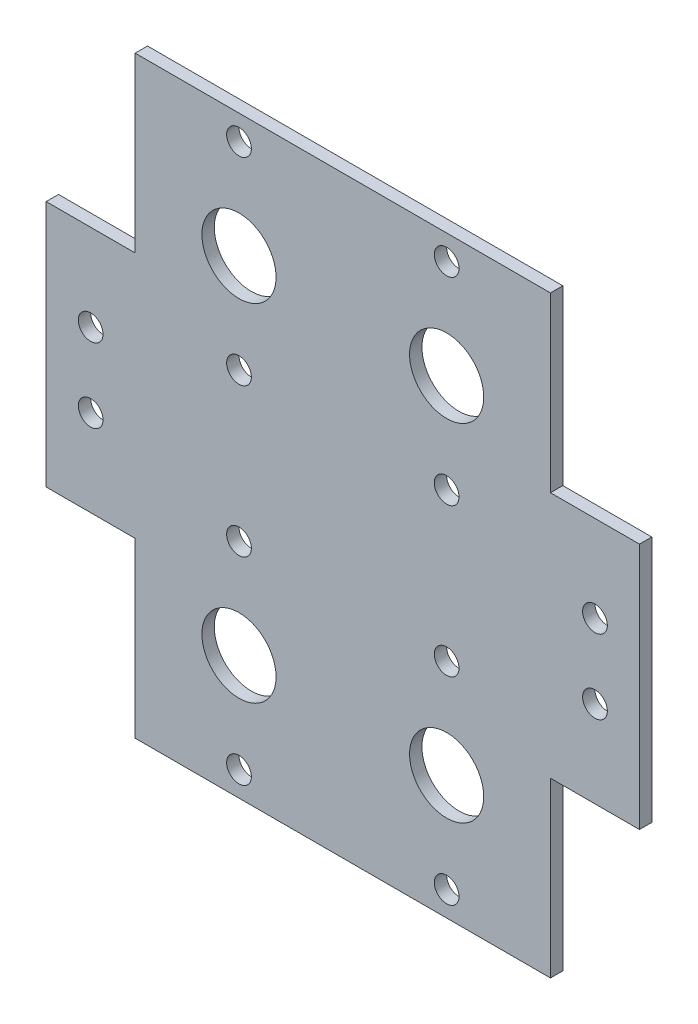
ISO-10303-21;
HEADER;
FILE_DESCRIPTION(('STEP AP214'),'2;1');
FILE_NAME('part.step','',(''),(''),'','','');
FILE_SCHEMA(('AUTOMOTIVE_DESIGN { 1 0 10303 214 1 1 1 1 }'));
ENDSEC;
DATA;
#1=APPLICATION_CONTEXT('core data for automotive mechanical design processes');
#2=APPLICATION_PROTOCOL_DEFINITION('international standard','automotive_design',2000,#1);
#3=PRODUCT_CONTEXT('',#1,'mechanical');
#4=PRODUCT('Part','Part','',(#3));
#5=PRODUCT_RELATED_PRODUCT_CATEGORY('part','',(#4));
#6=PRODUCT_DEFINITION_FORMATION('','',#4);
#7=PRODUCT_DEFINITION_CONTEXT('part definition',#1,'design');
#8=PRODUCT_DEFINITION('design','',#6,#7);
#9=PRODUCT_DEFINITION_SHAPE('','',#8);
#10=(LENGTH_UNIT() NAMED_UNIT(*) SI_UNIT(.MILLI.,.METRE.));
#11=(NAMED_UNIT(*) PLANE_ANGLE_UNIT() SI_UNIT($,.RADIAN.));
#12=(NAMED_UNIT(*) SI_UNIT($,.STERADIAN.) SOLID_ANGLE_UNIT());
#13=UNCERTAINTY_MEASURE_WITH_UNIT(LENGTH_MEASURE(1.E-05),#10,'distance_accuracy_value','');
#14=(GEOMETRIC_REPRESENTATION_CONTEXT(3) GLOBAL_UNCERTAINTY_ASSIGNED_CONTEXT((#13)) GLOBAL_UNIT_ASSIGNED_CONTEXT((#10,
#11,#12)) REPRESENTATION_CONTEXT('',''));
#15=CARTESIAN_POINT('',(0.,0.,0.));
#16=DIRECTION('',(0.,0.,1.));
#17=DIRECTION('',(1.,0.,0.));
#18=AXIS2_PLACEMENT_3D('',#15,#16,#17);
#19=CARTESIAN_POINT('',(-120.,50.,5.));
#20=DIRECTION('',(0.,-1.,0.));
#21=DIRECTION('',(0.,0.,-1.));
#22=AXIS2_PLACEMENT_3D('',#19,#20,#21);
#23=PLANE('',#22);
#24=DIRECTION('',(-1.,0.,0.));
#25=VECTOR('',#24,1.);
#26=CARTESIAN_POINT('',(-120.,50.,0.));
#27=LINE('',#26,#25);
#28=CARTESIAN_POINT('',(120.,50.,0.));
#29=VERTEX_POINT('',#28);
#30=CARTESIAN_POINT('',(84.,50.,0.));
#31=VERTEX_POINT('',#30);
#32=EDGE_CURVE('E210',#29,#31,#27,.T.);
#33=ORIENTED_EDGE('',*,*,#32,.T.);
#34=DIRECTION('',(0.,0.,1.));
#35=VECTOR('',#34,1.);
#36=CARTESIAN_POINT('',(84.,50.,5.));
#37=LINE('',#36,#35);
#38=CARTESIAN_POINT('',(84.,50.,5.));
#39=VERTEX_POINT('',#38);
#40=EDGE_CURVE('E143',#31,#39,#37,.T.);
#41=ORIENTED_EDGE('',*,*,#40,.T.);
#42=DIRECTION('',(-1.,0.,0.));
#43=VECTOR('',#42,1.);
#44=CARTESIAN_POINT('',(-120.,50.,5.));
#45=LINE('',#44,#43);
#46=CARTESIAN_POINT('',(120.,50.,5.));
#47=VERTEX_POINT('',#46);
#48=EDGE_CURVE('E197',#47,#39,#45,.T.);
#49=ORIENTED_EDGE('',*,*,#48,.F.);
#50=DIRECTION('',(0.,0.,-1.));
#51=VECTOR('',#50,1.);
#52=CARTESIAN_POINT('',(120.,50.,5.));
#53=LINE('',#52,#51);
#54=EDGE_CURVE('E13',#47,#29,#53,.T.);
#55=ORIENTED_EDGE('',*,*,#54,.T.);
#56=EDGE_LOOP('',(#33,#41,#49,#55));
#57=FACE_BOUND('',#56,.T.);
#58=ADVANCED_FACE('F47',(#57),#23,.F.);
#59=CARTESIAN_POINT('',(-120.,-50.,5.));
#60=DIRECTION('',(0.,1.,0.));
#61=DIRECTION('',(0.,0.,1.));
#62=AXIS2_PLACEMENT_3D('',#59,#60,#61);
#63=PLANE('',#62);
#64=DIRECTION('',(1.,0.,0.));
#65=VECTOR('',#64,1.);
#66=CARTESIAN_POINT('',(-120.,-50.,5.));
#67=LINE('',#66,#65);
#68=CARTESIAN_POINT('',(84.,-50.,5.));
#69=VERTEX_POINT('',#68);
#70=CARTESIAN_POINT('',(120.,-50.,5.));
#71=VERTEX_POINT('',#70);
#72=EDGE_CURVE('E202',#69,#71,#67,.T.);
#73=ORIENTED_EDGE('',*,*,#72,.F.);
#74=DIRECTION('',(0.,0.,-1.));
#75=VECTOR('',#74,1.);
#76=CARTESIAN_POINT('',(84.,-50.,5.));
#77=LINE('',#76,#75);
#78=CARTESIAN_POINT('',(84.,-50.,0.));
#79=VERTEX_POINT('',#78);
#80=EDGE_CURVE('E187',#69,#79,#77,.T.);
#81=ORIENTED_EDGE('',*,*,#80,.T.);
#82=DIRECTION('',(1.,0.,0.));
#83=VECTOR('',#82,1.);
#84=CARTESIAN_POINT('',(-120.,-50.,0.));
#85=LINE('',#84,#83);
#86=CARTESIAN_POINT('',(120.,-50.,0.));
#87=VERTEX_POINT('',#86);
#88=EDGE_CURVE('E214',#79,#87,#85,.T.);
#89=ORIENTED_EDGE('',*,*,#88,.T.);
#90=DIRECTION('',(0.,0.,-1.));
#91=VECTOR('',#90,1.);
#92=CARTESIAN_POINT('',(120.,-50.,5.));
#93=LINE('',#92,#91);
#94=EDGE_CURVE('E206',#71,#87,#93,.T.);
#95=ORIENTED_EDGE('',*,*,#94,.F.);
#96=EDGE_LOOP('',(#73,#81,#89,#95));
#97=FACE_BOUND('',#96,.T.);
#98=ADVANCED_FACE('F394',(#97),#63,.F.);
#99=CARTESIAN_POINT('',(120.,-50.,5.));
#100=DIRECTION('',(-1.,0.,0.));
#101=DIRECTION('',(0.,0.,1.));
#102=AXIS2_PLACEMENT_3D('',#99,#100,#101);
#103=PLANE('',#102);
#104=DIRECTION('',(0.,1.,0.));
#105=VECTOR('',#104,1.);
#106=CARTESIAN_POINT('',(120.,-50.,0.));
#107=LINE('',#106,#105);
#108=EDGE_CURVE('E191',#87,#29,#107,.T.);
#109=ORIENTED_EDGE('',*,*,#108,.T.);
#110=ORIENTED_EDGE('',*,*,#54,.F.);
#111=DIRECTION('',(0.,1.,0.));
#112=VECTOR('',#111,1.);
#113=CARTESIAN_POINT('',(120.,-50.,5.));
#114=LINE('',#113,#112);
#115=EDGE_CURVE('E192',#71,#47,#114,.T.);
#116=ORIENTED_EDGE('',*,*,#115,.F.);
#117=ORIENTED_EDGE('',*,*,#94,.T.);
#118=EDGE_LOOP('',(#109,#110,#116,#117));
#119=FACE_BOUND('',#118,.T.);
#120=ADVANCED_FACE('F49',(#119),#103,.F.);
#121=CARTESIAN_POINT('',(-84.,50.,5.));
#122=VERTEX_POINT('',#121);
#123=CARTESIAN_POINT('',(-120.,50.,5.));
#124=VERTEX_POINT('',#123);
#125=EDGE_CURVE('E195',#122,#124,#45,.T.);
#126=ORIENTED_EDGE('',*,*,#125,.F.);
#127=DIRECTION('',(0.,0.,-1.));
#128=VECTOR('',#127,1.);
#129=CARTESIAN_POINT('',(-84.,50.,5.));
#130=LINE('',#129,#128);
#131=CARTESIAN_POINT('',(-84.,50.,0.));
#132=VERTEX_POINT('',#131);
#133=EDGE_CURVE('E184',#122,#132,#130,.T.);
#134=ORIENTED_EDGE('',*,*,#133,.T.);
#135=CARTESIAN_POINT('',(-120.,50.,0.));
#136=VERTEX_POINT('',#135);
#137=EDGE_CURVE('E209',#132,#136,#27,.T.);
#138=ORIENTED_EDGE('',*,*,#137,.T.);
#139=DIRECTION('',(0.,0.,-1.));
#140=VECTOR('',#139,1.);
#141=CARTESIAN_POINT('',(-120.,50.,5.));
#142=LINE('',#141,#140);
#143=EDGE_CURVE('E55',#124,#136,#142,.T.);
#144=ORIENTED_EDGE('',*,*,#143,.F.);
#145=EDGE_LOOP('',(#126,#134,#138,#144));
#146=FACE_BOUND('',#145,.T.);
#147=ADVANCED_FACE('F237',(#146),#23,.F.);
#148=CARTESIAN_POINT('',(-120.,-50.,5.));
#149=DIRECTION('',(1.,0.,0.));
#150=DIRECTION('',(0.,0.,-1.));
#151=AXIS2_PLACEMENT_3D('',#148,#149,#150);
#152=PLANE('',#151);
#153=DIRECTION('',(0.,-1.,0.));
#154=VECTOR('',#153,1.);
#155=CARTESIAN_POINT('',(-120.,-50.,0.));
#156=LINE('',#155,#154);
#157=CARTESIAN_POINT('',(-120.,-50.,0.));
#158=VERTEX_POINT('',#157);
#159=EDGE_CURVE('E212',#136,#158,#156,.T.);
#160=ORIENTED_EDGE('',*,*,#159,.T.);
#161=DIRECTION('',(0.,0.,-1.));
#162=VECTOR('',#161,1.);
#163=CARTESIAN_POINT('',(-120.,-50.,5.));
#164=LINE('',#163,#162);
#165=CARTESIAN_POINT('',(-120.,-50.,5.));
#166=VERTEX_POINT('',#165);
#167=EDGE_CURVE('E219',#166,#158,#164,.T.);
#168=ORIENTED_EDGE('',*,*,#167,.F.);
#169=DIRECTION('',(0.,-1.,0.));
#170=VECTOR('',#169,1.);
#171=CARTESIAN_POINT('',(-120.,-50.,5.));
#172=LINE('',#171,#170);
#173=EDGE_CURVE('E200',#124,#166,#172,.T.);
#174=ORIENTED_EDGE('',*,*,#173,.F.);
#175=ORIENTED_EDGE('',*,*,#143,.T.);
#176=EDGE_LOOP('',(#160,#168,#174,#175));
#177=FACE_BOUND('',#176,.T.);
#178=ADVANCED_FACE('F226',(#177),#152,.F.);
#179=CARTESIAN_POINT('',(-84.,-50.,0.));
#180=VERTEX_POINT('',#179);
#181=EDGE_CURVE('E196',#158,#180,#85,.T.);
#182=ORIENTED_EDGE('',*,*,#181,.T.);
#183=DIRECTION('',(0.,0.,1.));
#184=VECTOR('',#183,1.);
#185=CARTESIAN_POINT('',(-84.,-50.,5.));
#186=LINE('',#185,#184);
#187=CARTESIAN_POINT('',(-84.,-50.,5.));
#188=VERTEX_POINT('',#187);
#189=EDGE_CURVE('E177',#180,#188,#186,.T.);
#190=ORIENTED_EDGE('',*,*,#189,.T.);
#191=EDGE_CURVE('E203',#166,#188,#67,.T.);
#192=ORIENTED_EDGE('',*,*,#191,.F.);
#193=ORIENTED_EDGE('',*,*,#167,.T.);
#194=EDGE_LOOP('',(#182,#190,#192,#193));
#195=FACE_BOUND('',#194,.T.);
#196=ADVANCED_FACE('F234',(#195),#63,.F.);
#197=CARTESIAN_POINT('',(0.,0.,5.));
#198=DIRECTION('',(0.,0.,-1.));
#199=DIRECTION('',(-1.,0.,0.));
#200=AXIS2_PLACEMENT_3D('',#197,#198,#199);
#201=PLANE('',#200);
#202=CARTESIAN_POINT('',(42.,-30.,5.));
#203=DIRECTION('',(0.,0.,1.));
#204=DIRECTION('',(-1.,0.,0.));
#205=AXIS2_PLACEMENT_3D('',#202,#203,#204);
#206=CIRCLE('',#205,5.);
#207=CARTESIAN_POINT('',(37.,-30.,5.));
#208=VERTEX_POINT('',#207);
#209=EDGE_CURVE('E292',#208,#208,#206,.T.);
#210=ORIENTED_EDGE('',*,*,#209,.F.);
#211=EDGE_LOOP('',(#210));
#212=FACE_BOUND('',#211,.T.);
#213=CARTESIAN_POINT('',(42.,-110.,5.));
#214=DIRECTION('',(0.,0.,1.));
#215=DIRECTION('',(-1.,0.,0.));
#216=AXIS2_PLACEMENT_3D('',#213,#214,#215);
#217=CIRCLE('',#216,5.);
#218=CARTESIAN_POINT('',(37.,-110.,5.));
#219=VERTEX_POINT('',#218);
#220=EDGE_CURVE('E327',#219,#219,#217,.T.);
#221=ORIENTED_EDGE('',*,*,#220,.F.);
#222=EDGE_LOOP('',(#221));
#223=FACE_BOUND('',#222,.T.);
#224=CARTESIAN_POINT('',(-42.,-110.,5.));
#225=DIRECTION('',(0.,0.,1.));
#226=DIRECTION('',(1.,0.,0.));
#227=AXIS2_PLACEMENT_3D('',#224,#225,#226);
#228=CIRCLE('',#227,5.);
#229=CARTESIAN_POINT('',(-37.,-110.,5.));
#230=VERTEX_POINT('',#229);
#231=EDGE_CURVE('E333',#230,#230,#228,.T.);
#232=ORIENTED_EDGE('',*,*,#231,.F.);
#233=EDGE_LOOP('',(#232));
#234=FACE_BOUND('',#233,.T.);
#235=CARTESIAN_POINT('',(-42.,-30.,5.));
#236=DIRECTION('',(0.,0.,1.));
#237=DIRECTION('',(1.,0.,0.));
#238=AXIS2_PLACEMENT_3D('',#235,#236,#237);
#239=CIRCLE('',#238,5.);
#240=CARTESIAN_POINT('',(-37.,-30.,5.));
#241=VERTEX_POINT('',#240);
#242=EDGE_CURVE('E310',#241,#241,#239,.T.);
#243=ORIENTED_EDGE('',*,*,#242,.F.);
#244=EDGE_LOOP('',(#243));
#245=FACE_BOUND('',#244,.T.);
#246=CARTESIAN_POINT('',(42.,-70.,5.));
#247=DIRECTION('',(0.,0.,1.));
#248=DIRECTION('',(-1.,0.,0.));
#249=AXIS2_PLACEMENT_3D('',#246,#247,#248);
#250=CIRCLE('',#249,15.);
#251=CARTESIAN_POINT('',(27.,-70.,5.));
#252=VERTEX_POINT('',#251);
#253=EDGE_CURVE('E317',#252,#252,#250,.T.);
#254=ORIENTED_EDGE('',*,*,#253,.F.);
#255=EDGE_LOOP('',(#254));
#256=FACE_BOUND('',#255,.T.);
#257=CARTESIAN_POINT('',(-42.,70.,5.));
#258=DIRECTION('',(0.,0.,1.));
#259=DIRECTION('',(-1.,0.,0.));
#260=AXIS2_PLACEMENT_3D('',#257,#258,#259);
#261=CIRCLE('',#260,15.);
#262=CARTESIAN_POINT('',(-57.,70.,5.));
#263=VERTEX_POINT('',#262);
#264=EDGE_CURVE('E293',#263,#263,#261,.T.);
#265=ORIENTED_EDGE('',*,*,#264,.F.);
#266=EDGE_LOOP('',(#265));
#267=FACE_BOUND('',#266,.T.);
#268=CARTESIAN_POINT('',(42.,70.,5.));
#269=DIRECTION('',(0.,0.,1.));
#270=DIRECTION('',(1.,0.,0.));
#271=AXIS2_PLACEMENT_3D('',#268,#269,#270);
#272=CIRCLE('',#271,15.);
#273=CARTESIAN_POINT('',(57.,70.,5.));
#274=VERTEX_POINT('',#273);
#275=EDGE_CURVE('E299',#274,#274,#272,.T.);
#276=ORIENTED_EDGE('',*,*,#275,.F.);
#277=EDGE_LOOP('',(#276));
#278=FACE_BOUND('',#277,.T.);
#279=CARTESIAN_POINT('',(-42.,30.,5.));
#280=DIRECTION('',(0.,0.,1.));
#281=DIRECTION('',(-1.,0.,0.));
#282=AXIS2_PLACEMENT_3D('',#279,#280,#281);
#283=CIRCLE('',#282,5.);
#284=CARTESIAN_POINT('',(-47.,30.,5.));
#285=VERTEX_POINT('',#284);
#286=EDGE_CURVE('E305',#285,#285,#283,.T.);
#287=ORIENTED_EDGE('',*,*,#286,.F.);
#288=EDGE_LOOP('',(#287));
#289=FACE_BOUND('',#288,.T.);
#290=CARTESIAN_POINT('',(-42.,110.,5.));
#291=DIRECTION('',(0.,0.,1.));
#292=DIRECTION('',(-1.,0.,0.));
#293=AXIS2_PLACEMENT_3D('',#290,#291,#292);
#294=CIRCLE('',#293,5.);
#295=CARTESIAN_POINT('',(-47.,110.,5.));
#296=VERTEX_POINT('',#295);
#297=EDGE_CURVE('E273',#296,#296,#294,.T.);
#298=ORIENTED_EDGE('',*,*,#297,.F.);
#299=EDGE_LOOP('',(#298));
#300=FACE_BOUND('',#299,.T.);
#301=CARTESIAN_POINT('',(42.,110.,5.));
#302=DIRECTION('',(0.,0.,1.));
#303=DIRECTION('',(1.,0.,0.));
#304=AXIS2_PLACEMENT_3D('',#301,#302,#303);
#305=CIRCLE('',#304,5.);
#306=CARTESIAN_POINT('',(47.,110.,5.));
#307=VERTEX_POINT('',#306);
#308=EDGE_CURVE('E280',#307,#307,#305,.T.);
#309=ORIENTED_EDGE('',*,*,#308,.F.);
#310=EDGE_LOOP('',(#309));
#311=FACE_BOUND('',#310,.T.);
#312=CARTESIAN_POINT('',(42.,30.,5.));
#313=DIRECTION('',(0.,0.,1.));
#314=DIRECTION('',(1.,0.,0.));
#315=AXIS2_PLACEMENT_3D('',#312,#313,#314);
#316=CIRCLE('',#315,5.);
#317=CARTESIAN_POINT('',(47.,30.,5.));
#318=VERTEX_POINT('',#317);
#319=EDGE_CURVE('E286',#318,#318,#316,.T.);
#320=ORIENTED_EDGE('',*,*,#319,.F.);
#321=EDGE_LOOP('',(#320));
#322=FACE_BOUND('',#321,.T.);
#323=CARTESIAN_POINT('',(-42.,-70.,5.));
#324=DIRECTION('',(0.,0.,1.));
#325=DIRECTION('',(1.,0.,0.));
#326=AXIS2_PLACEMENT_3D('',#323,#324,#325);
#327=CIRCLE('',#326,15.);
#328=CARTESIAN_POINT('',(-27.,-70.,5.));
#329=VERTEX_POINT('',#328);
#330=EDGE_CURVE('E267',#329,#329,#327,.T.);
#331=ORIENTED_EDGE('',*,*,#330,.F.);
#332=EDGE_LOOP('',(#331));
#333=FACE_BOUND('',#332,.T.);
#334=CARTESIAN_POINT('',(102.,15.,5.));
#335=DIRECTION('',(0.,0.,1.));
#336=DIRECTION('',(-1.,0.,0.));
#337=AXIS2_PLACEMENT_3D('',#334,#335,#336);
#338=CIRCLE('',#337,5.);
#339=CARTESIAN_POINT('',(97.,15.,5.));
#340=VERTEX_POINT('',#339);
#341=EDGE_CURVE('E262',#340,#340,#338,.T.);
#342=ORIENTED_EDGE('',*,*,#341,.F.);
#343=EDGE_LOOP('',(#342));
#344=FACE_BOUND('',#343,.T.);
#345=CARTESIAN_POINT('',(102.,-15.,5.));
#346=DIRECTION('',(0.,0.,1.));
#347=DIRECTION('',(1.,0.,0.));
#348=AXIS2_PLACEMENT_3D('',#345,#346,#347);
#349=CIRCLE('',#348,5.);
#350=CARTESIAN_POINT('',(107.,-15.,5.));
#351=VERTEX_POINT('',#350);
#352=EDGE_CURVE('E256',#351,#351,#349,.T.);
#353=ORIENTED_EDGE('',*,*,#352,.F.);
#354=EDGE_LOOP('',(#353));
#355=FACE_BOUND('',#354,.T.);
#356=CARTESIAN_POINT('',(-102.,-15.,5.));
#357=DIRECTION('',(0.,0.,1.));
#358=DIRECTION('',(-1.,0.,0.));
#359=AXIS2_PLACEMENT_3D('',#356,#357,#358);
#360=CIRCLE('',#359,5.00000000000001);
#361=CARTESIAN_POINT('',(-107.,-15.,5.));
#362=VERTEX_POINT('',#361);
#363=EDGE_CURVE('E249',#362,#362,#360,.T.);
#364=ORIENTED_EDGE('',*,*,#363,.F.);
#365=EDGE_LOOP('',(#364));
#366=FACE_BOUND('',#365,.T.);
#367=CARTESIAN_POINT('',(-102.,15.,5.));
#368=DIRECTION('',(0.,0.,1.));
#369=DIRECTION('',(1.,0.,0.));
#370=AXIS2_PLACEMENT_3D('',#367,#368,#369);
#371=CIRCLE('',#370,5.);
#372=CARTESIAN_POINT('',(-97.,15.,5.));
#373=VERTEX_POINT('',#372);
#374=EDGE_CURVE('E242',#373,#373,#371,.T.);
#375=ORIENTED_EDGE('',*,*,#374,.F.);
#376=EDGE_LOOP('',(#375));
#377=FACE_BOUND('',#376,.T.);
#378=ORIENTED_EDGE('',*,*,#191,.T.);
#379=DIRECTION('',(0.,-1.,0.));
#380=VECTOR('',#379,1.);
#381=CARTESIAN_POINT('',(-84.,-120.,5.));
#382=LINE('',#381,#380);
#383=CARTESIAN_POINT('',(-84.,-120.,5.));
#384=VERTEX_POINT('',#383);
#385=EDGE_CURVE('E172',#188,#384,#382,.T.);
#386=ORIENTED_EDGE('',*,*,#385,.T.);
#387=DIRECTION('',(1.,0.,0.));
#388=VECTOR('',#387,1.);
#389=CARTESIAN_POINT('',(-84.,-120.,5.));
#390=LINE('',#389,#388);
#391=CARTESIAN_POINT('',(84.,-120.,5.));
#392=VERTEX_POINT('',#391);
#393=EDGE_CURVE('E148',#384,#392,#390,.T.);
#394=ORIENTED_EDGE('',*,*,#393,.T.);
#395=DIRECTION('',(0.,1.,0.));
#396=VECTOR('',#395,1.);
#397=CARTESIAN_POINT('',(84.,-120.,5.));
#398=LINE('',#397,#396);
#399=EDGE_CURVE('E62',#392,#69,#398,.T.);
#400=ORIENTED_EDGE('',*,*,#399,.T.);
#401=ORIENTED_EDGE('',*,*,#72,.T.);
#402=ORIENTED_EDGE('',*,*,#115,.T.);
#403=ORIENTED_EDGE('',*,*,#48,.T.);
#404=CARTESIAN_POINT('',(84.,120.,5.));
#405=VERTEX_POINT('',#404);
#406=EDGE_CURVE('E170',#39,#405,#398,.T.);
#407=ORIENTED_EDGE('',*,*,#406,.T.);
#408=DIRECTION('',(-1.,0.,0.));
#409=VECTOR('',#408,1.);
#410=CARTESIAN_POINT('',(-84.,120.,5.));
#411=LINE('',#410,#409);
#412=CARTESIAN_POINT('',(-84.,120.,5.));
#413=VERTEX_POINT('',#412);
#414=EDGE_CURVE('E154',#405,#413,#411,.T.);
#415=ORIENTED_EDGE('',*,*,#414,.T.);
#416=EDGE_CURVE('E69',#413,#122,#382,.T.);
#417=ORIENTED_EDGE('',*,*,#416,.T.);
#418=ORIENTED_EDGE('',*,*,#125,.T.);
#419=ORIENTED_EDGE('',*,*,#173,.T.);
#420=EDGE_LOOP('',(#378,#386,#394,#400,#401,#402,#403,#407,#415,#417,#418,#419));
#421=FACE_BOUND('',#420,.T.);
#422=ADVANCED_FACE('F236',(#212,#223,#234,#245,#256,#267,#278,#289,#300,#311,#322,#333,#344,
#355,#366,#377,#421),#201,.F.);
#423=CARTESIAN_POINT('',(0.,0.,0.));
#424=DIRECTION('',(0.,0.,-1.));
#425=DIRECTION('',(-1.,0.,0.));
#426=AXIS2_PLACEMENT_3D('',#423,#424,#425);
#427=PLANE('',#426);
#428=CARTESIAN_POINT('',(42.,-30.,0.));
#429=DIRECTION('',(0.,0.,1.));
#430=DIRECTION('',(-1.,0.,0.));
#431=AXIS2_PLACEMENT_3D('',#428,#429,#430);
#432=CIRCLE('',#431,5.);
#433=CARTESIAN_POINT('',(37.,-30.,0.));
#434=VERTEX_POINT('',#433);
#435=EDGE_CURVE('E324',#434,#434,#432,.T.);
#436=ORIENTED_EDGE('',*,*,#435,.T.);
#437=EDGE_LOOP('',(#436));
#438=FACE_BOUND('',#437,.T.);
#439=CARTESIAN_POINT('',(42.,-110.,0.));
#440=DIRECTION('',(0.,0.,1.));
#441=DIRECTION('',(-1.,0.,0.));
#442=AXIS2_PLACEMENT_3D('',#439,#440,#441);
#443=CIRCLE('',#442,5.);
#444=CARTESIAN_POINT('',(37.,-110.,0.));
#445=VERTEX_POINT('',#444);
#446=EDGE_CURVE('E330',#445,#445,#443,.T.);
#447=ORIENTED_EDGE('',*,*,#446,.T.);
#448=EDGE_LOOP('',(#447));
#449=FACE_BOUND('',#448,.T.);
#450=CARTESIAN_POINT('',(-42.,-110.,0.));
#451=DIRECTION('',(0.,0.,1.));
#452=DIRECTION('',(1.,0.,0.));
#453=AXIS2_PLACEMENT_3D('',#450,#451,#452);
#454=CIRCLE('',#453,5.);
#455=CARTESIAN_POINT('',(-37.,-110.,0.));
#456=VERTEX_POINT('',#455);
#457=EDGE_CURVE('E314',#456,#456,#454,.T.);
#458=ORIENTED_EDGE('',*,*,#457,.T.);
#459=EDGE_LOOP('',(#458));
#460=FACE_BOUND('',#459,.T.);
#461=CARTESIAN_POINT('',(-42.,-30.,0.));
#462=DIRECTION('',(0.,0.,1.));
#463=DIRECTION('',(1.,0.,0.));
#464=AXIS2_PLACEMENT_3D('',#461,#462,#463);
#465=CIRCLE('',#464,5.);
#466=CARTESIAN_POINT('',(-37.,-30.,0.));
#467=VERTEX_POINT('',#466);
#468=EDGE_CURVE('E313',#467,#467,#465,.T.);
#469=ORIENTED_EDGE('',*,*,#468,.T.);
#470=EDGE_LOOP('',(#469));
#471=FACE_BOUND('',#470,.T.);
#472=CARTESIAN_POINT('',(42.,-70.,0.));
#473=DIRECTION('',(0.,0.,1.));
#474=DIRECTION('',(-1.,0.,0.));
#475=AXIS2_PLACEMENT_3D('',#472,#473,#474);
#476=CIRCLE('',#475,15.);
#477=CARTESIAN_POINT('',(27.,-70.,0.));
#478=VERTEX_POINT('',#477);
#479=EDGE_CURVE('E270',#478,#478,#476,.T.);
#480=ORIENTED_EDGE('',*,*,#479,.T.);
#481=EDGE_LOOP('',(#480));
#482=FACE_BOUND('',#481,.T.);
#483=CARTESIAN_POINT('',(-42.,70.,0.));
#484=DIRECTION('',(0.,0.,1.));
#485=DIRECTION('',(-1.,0.,0.));
#486=AXIS2_PLACEMENT_3D('',#483,#484,#485);
#487=CIRCLE('',#486,15.);
#488=CARTESIAN_POINT('',(-57.,70.,0.));
#489=VERTEX_POINT('',#488);
#490=EDGE_CURVE('E296',#489,#489,#487,.T.);
#491=ORIENTED_EDGE('',*,*,#490,.T.);
#492=EDGE_LOOP('',(#491));
#493=FACE_BOUND('',#492,.T.);
#494=CARTESIAN_POINT('',(42.,70.,0.));
#495=DIRECTION('',(0.,0.,1.));
#496=DIRECTION('',(1.,0.,0.));
#497=AXIS2_PLACEMENT_3D('',#494,#495,#496);
#498=CIRCLE('',#497,15.);
#499=CARTESIAN_POINT('',(57.,70.,0.));
#500=VERTEX_POINT('',#499);
#501=EDGE_CURVE('E302',#500,#500,#498,.T.);
#502=ORIENTED_EDGE('',*,*,#501,.T.);
#503=EDGE_LOOP('',(#502));
#504=FACE_BOUND('',#503,.T.);
#505=CARTESIAN_POINT('',(-42.,30.,0.));
#506=DIRECTION('',(0.,0.,1.));
#507=DIRECTION('',(-1.,0.,0.));
#508=AXIS2_PLACEMENT_3D('',#505,#506,#507);
#509=CIRCLE('',#508,5.);
#510=CARTESIAN_POINT('',(-47.,30.,0.));
#511=VERTEX_POINT('',#510);
#512=EDGE_CURVE('E277',#511,#511,#509,.T.);
#513=ORIENTED_EDGE('',*,*,#512,.T.);
#514=EDGE_LOOP('',(#513));
#515=FACE_BOUND('',#514,.T.);
#516=CARTESIAN_POINT('',(-42.,110.,0.));
#517=DIRECTION('',(0.,0.,1.));
#518=DIRECTION('',(-1.,0.,0.));
#519=AXIS2_PLACEMENT_3D('',#516,#517,#518);
#520=CIRCLE('',#519,5.);
#521=CARTESIAN_POINT('',(-47.,110.,0.));
#522=VERTEX_POINT('',#521);
#523=EDGE_CURVE('E276',#522,#522,#520,.T.);
#524=ORIENTED_EDGE('',*,*,#523,.T.);
#525=EDGE_LOOP('',(#524));
#526=FACE_BOUND('',#525,.T.);
#527=CARTESIAN_POINT('',(42.,110.,0.));
#528=DIRECTION('',(0.,0.,1.));
#529=DIRECTION('',(1.,0.,0.));
#530=AXIS2_PLACEMENT_3D('',#527,#528,#529);
#531=CIRCLE('',#530,5.);
#532=CARTESIAN_POINT('',(47.,110.,0.));
#533=VERTEX_POINT('',#532);
#534=EDGE_CURVE('E283',#533,#533,#531,.T.);
#535=ORIENTED_EDGE('',*,*,#534,.T.);
#536=EDGE_LOOP('',(#535));
#537=FACE_BOUND('',#536,.T.);
#538=CARTESIAN_POINT('',(42.,30.,0.));
#539=DIRECTION('',(0.,0.,1.));
#540=DIRECTION('',(1.,0.,0.));
#541=AXIS2_PLACEMENT_3D('',#538,#539,#540);
#542=CIRCLE('',#541,5.);
#543=CARTESIAN_POINT('',(47.,30.,0.));
#544=VERTEX_POINT('',#543);
#545=EDGE_CURVE('E289',#544,#544,#542,.T.);
#546=ORIENTED_EDGE('',*,*,#545,.T.);
#547=EDGE_LOOP('',(#546));
#548=FACE_BOUND('',#547,.T.);
#549=CARTESIAN_POINT('',(-42.,-70.,0.));
#550=DIRECTION('',(0.,0.,1.));
#551=DIRECTION('',(1.,0.,0.));
#552=AXIS2_PLACEMENT_3D('',#549,#550,#551);
#553=CIRCLE('',#552,15.);
#554=CARTESIAN_POINT('',(-27.,-70.,0.));
#555=VERTEX_POINT('',#554);
#556=EDGE_CURVE('E253',#555,#555,#553,.T.);
#557=ORIENTED_EDGE('',*,*,#556,.T.);
#558=EDGE_LOOP('',(#557));
#559=FACE_BOUND('',#558,.T.);
#560=CARTESIAN_POINT('',(102.,15.,0.));
#561=DIRECTION('',(0.,0.,1.));
#562=DIRECTION('',(-1.,0.,0.));
#563=AXIS2_PLACEMENT_3D('',#560,#561,#562);
#564=CIRCLE('',#563,5.);
#565=CARTESIAN_POINT('',(97.,15.,0.));
#566=VERTEX_POINT('',#565);
#567=EDGE_CURVE('E247',#566,#566,#564,.T.);
#568=ORIENTED_EDGE('',*,*,#567,.T.);
#569=EDGE_LOOP('',(#568));
#570=FACE_BOUND('',#569,.T.);
#571=CARTESIAN_POINT('',(102.,-15.,0.));
#572=DIRECTION('',(0.,0.,1.));
#573=DIRECTION('',(1.,0.,0.));
#574=AXIS2_PLACEMENT_3D('',#571,#572,#573);
#575=CIRCLE('',#574,5.);
#576=CARTESIAN_POINT('',(107.,-15.,0.));
#577=VERTEX_POINT('',#576);
#578=EDGE_CURVE('E259',#577,#577,#575,.T.);
#579=ORIENTED_EDGE('',*,*,#578,.T.);
#580=EDGE_LOOP('',(#579));
#581=FACE_BOUND('',#580,.T.);
#582=CARTESIAN_POINT('',(-102.,-15.,0.));
#583=DIRECTION('',(0.,0.,1.));
#584=DIRECTION('',(-1.,0.,0.));
#585=AXIS2_PLACEMENT_3D('',#582,#583,#584);
#586=CIRCLE('',#585,5.00000000000001);
#587=CARTESIAN_POINT('',(-107.,-15.,0.));
#588=VERTEX_POINT('',#587);
#589=EDGE_CURVE('E252',#588,#588,#586,.T.);
#590=ORIENTED_EDGE('',*,*,#589,.T.);
#591=EDGE_LOOP('',(#590));
#592=FACE_BOUND('',#591,.T.);
#593=CARTESIAN_POINT('',(-102.,15.,0.));
#594=DIRECTION('',(0.,0.,1.));
#595=DIRECTION('',(1.,0.,0.));
#596=AXIS2_PLACEMENT_3D('',#593,#594,#595);
#597=CIRCLE('',#596,5.);
#598=CARTESIAN_POINT('',(-97.,15.,0.));
#599=VERTEX_POINT('',#598);
#600=EDGE_CURVE('E240',#599,#599,#597,.T.);
#601=ORIENTED_EDGE('',*,*,#600,.T.);
#602=EDGE_LOOP('',(#601));
#603=FACE_BOUND('',#602,.T.);
#604=ORIENTED_EDGE('',*,*,#137,.F.);
#605=DIRECTION('',(0.,-1.,0.));
#606=VECTOR('',#605,1.);
#607=CARTESIAN_POINT('',(-84.,-120.,0.));
#608=LINE('',#607,#606);
#609=CARTESIAN_POINT('',(-84.,120.,0.));
#610=VERTEX_POINT('',#609);
#611=EDGE_CURVE('E161',#610,#132,#608,.T.);
#612=ORIENTED_EDGE('',*,*,#611,.F.);
#613=DIRECTION('',(-1.,0.,0.));
#614=VECTOR('',#613,1.);
#615=CARTESIAN_POINT('',(-84.,120.,0.));
#616=LINE('',#615,#614);
#617=CARTESIAN_POINT('',(84.,120.,0.));
#618=VERTEX_POINT('',#617);
#619=EDGE_CURVE('E153',#618,#610,#616,.T.);
#620=ORIENTED_EDGE('',*,*,#619,.F.);
#621=DIRECTION('',(0.,1.,0.));
#622=VECTOR('',#621,1.);
#623=CARTESIAN_POINT('',(84.,-120.,0.));
#624=LINE('',#623,#622);
#625=EDGE_CURVE('E137',#31,#618,#624,.T.);
#626=ORIENTED_EDGE('',*,*,#625,.F.);
#627=ORIENTED_EDGE('',*,*,#32,.F.);
#628=ORIENTED_EDGE('',*,*,#108,.F.);
#629=ORIENTED_EDGE('',*,*,#88,.F.);
#630=CARTESIAN_POINT('',(84.,-120.,0.));
#631=VERTEX_POINT('',#630);
#632=EDGE_CURVE('E147',#631,#79,#624,.T.);
#633=ORIENTED_EDGE('',*,*,#632,.F.);
#634=DIRECTION('',(1.,0.,0.));
#635=VECTOR('',#634,1.);
#636=CARTESIAN_POINT('',(-84.,-120.,0.));
#637=LINE('',#636,#635);
#638=CARTESIAN_POINT('',(-84.,-120.,0.));
#639=VERTEX_POINT('',#638);
#640=EDGE_CURVE('E156',#639,#631,#637,.T.);
#641=ORIENTED_EDGE('',*,*,#640,.F.);
#642=EDGE_CURVE('E162',#180,#639,#608,.T.);
#643=ORIENTED_EDGE('',*,*,#642,.F.);
#644=ORIENTED_EDGE('',*,*,#181,.F.);
#645=ORIENTED_EDGE('',*,*,#159,.F.);
#646=EDGE_LOOP('',(#604,#612,#620,#626,#627,#628,#629,#633,#641,#643,#644,#645));
#647=FACE_BOUND('',#646,.T.);
#648=ADVANCED_FACE('F160',(#438,#449,#460,#471,#482,#493,#504,#515,#526,#537,#548,#559,#570,
#581,#592,#603,#647),#427,.T.);
#649=CARTESIAN_POINT('',(-84.,-120.,0.));
#650=DIRECTION('',(0.,-1.,0.));
#651=DIRECTION('',(0.,0.,-1.));
#652=AXIS2_PLACEMENT_3D('',#649,#650,#651);
#653=PLANE('',#652);
#654=ORIENTED_EDGE('',*,*,#393,.F.);
#655=DIRECTION('',(0.,0.,1.));
#656=VECTOR('',#655,1.);
#657=CARTESIAN_POINT('',(-84.,-120.,0.));
#658=LINE('',#657,#656);
#659=EDGE_CURVE('E178',#639,#384,#658,.T.);
#660=ORIENTED_EDGE('',*,*,#659,.F.);
#661=ORIENTED_EDGE('',*,*,#640,.T.);
#662=DIRECTION('',(0.,0.,1.));
#663=VECTOR('',#662,1.);
#664=CARTESIAN_POINT('',(84.,-120.,0.));
#665=LINE('',#664,#663);
#666=EDGE_CURVE('E175',#631,#392,#665,.T.);
#667=ORIENTED_EDGE('',*,*,#666,.T.);
#668=EDGE_LOOP('',(#654,#660,#661,#667));
#669=FACE_BOUND('',#668,.T.);
#670=ADVANCED_FACE('F422',(#669),#653,.T.);
#671=CARTESIAN_POINT('',(-84.,-120.,0.));
#672=DIRECTION('',(-1.,0.,0.));
#673=DIRECTION('',(0.,0.,1.));
#674=AXIS2_PLACEMENT_3D('',#671,#672,#673);
#675=PLANE('',#674);
#676=ORIENTED_EDGE('',*,*,#189,.F.);
#677=ORIENTED_EDGE('',*,*,#642,.T.);
#678=ORIENTED_EDGE('',*,*,#659,.T.);
#679=ORIENTED_EDGE('',*,*,#385,.F.);
#680=EDGE_LOOP('',(#676,#677,#678,#679));
#681=FACE_BOUND('',#680,.T.);
#682=ADVANCED_FACE('F424',(#681),#675,.T.);
#683=CARTESIAN_POINT('',(84.,-120.,0.));
#684=DIRECTION('',(1.,0.,0.));
#685=DIRECTION('',(0.,0.,-1.));
#686=AXIS2_PLACEMENT_3D('',#683,#684,#685);
#687=PLANE('',#686);
#688=ORIENTED_EDGE('',*,*,#80,.F.);
#689=ORIENTED_EDGE('',*,*,#399,.F.);
#690=ORIENTED_EDGE('',*,*,#666,.F.);
#691=ORIENTED_EDGE('',*,*,#632,.T.);
#692=EDGE_LOOP('',(#688,#689,#690,#691));
#693=FACE_BOUND('',#692,.T.);
#694=ADVANCED_FACE('F418',(#693),#687,.T.);
#695=ORIENTED_EDGE('',*,*,#40,.F.);
#696=ORIENTED_EDGE('',*,*,#625,.T.);
#697=DIRECTION('',(0.,0.,1.));
#698=VECTOR('',#697,1.);
#699=CARTESIAN_POINT('',(84.,120.,0.));
#700=LINE('',#699,#698);
#701=EDGE_CURVE('E140',#618,#405,#700,.T.);
#702=ORIENTED_EDGE('',*,*,#701,.T.);
#703=ORIENTED_EDGE('',*,*,#406,.F.);
#704=EDGE_LOOP('',(#695,#696,#702,#703));
#705=FACE_BOUND('',#704,.T.);
#706=ADVANCED_FACE('F139',(#705),#687,.T.);
#707=ORIENTED_EDGE('',*,*,#133,.F.);
#708=ORIENTED_EDGE('',*,*,#416,.F.);
#709=DIRECTION('',(0.,0.,1.));
#710=VECTOR('',#709,1.);
#711=CARTESIAN_POINT('',(-84.,120.,0.));
#712=LINE('',#711,#710);
#713=EDGE_CURVE('E155',#610,#413,#712,.T.);
#714=ORIENTED_EDGE('',*,*,#713,.F.);
#715=ORIENTED_EDGE('',*,*,#611,.T.);
#716=EDGE_LOOP('',(#707,#708,#714,#715));
#717=FACE_BOUND('',#716,.T.);
#718=ADVANCED_FACE('F239',(#717),#675,.T.);
#719=CARTESIAN_POINT('',(-84.,120.,0.));
#720=DIRECTION('',(0.,1.,0.));
#721=DIRECTION('',(0.,0.,1.));
#722=AXIS2_PLACEMENT_3D('',#719,#720,#721);
#723=PLANE('',#722);
#724=ORIENTED_EDGE('',*,*,#414,.F.);
#725=ORIENTED_EDGE('',*,*,#701,.F.);
#726=ORIENTED_EDGE('',*,*,#619,.T.);
#727=ORIENTED_EDGE('',*,*,#713,.T.);
#728=EDGE_LOOP('',(#724,#725,#726,#727));
#729=FACE_BOUND('',#728,.T.);
#730=ADVANCED_FACE('F152',(#729),#723,.T.);
#731=CARTESIAN_POINT('',(-102.,15.,0.));
#732=DIRECTION('',(0.,0.,1.));
#733=DIRECTION('',(1.,0.,0.));
#734=AXIS2_PLACEMENT_3D('',#731,#732,#733);
#735=CYLINDRICAL_SURFACE('',#734,5.);
#736=ORIENTED_EDGE('',*,*,#600,.F.);
#737=EDGE_LOOP('',(#736));
#738=FACE_BOUND('',#737,.T.);
#739=ORIENTED_EDGE('',*,*,#374,.T.);
#740=EDGE_LOOP('',(#739));
#741=FACE_BOUND('',#740,.T.);
#742=ADVANCED_FACE('F379',(#738,#741),#735,.F.);
#743=CARTESIAN_POINT('',(-102.,-15.,0.));
#744=DIRECTION('',(0.,0.,1.));
#745=DIRECTION('',(1.,0.,0.));
#746=AXIS2_PLACEMENT_3D('',#743,#744,#745);
#747=CYLINDRICAL_SURFACE('',#746,5.00000000000001);
#748=ORIENTED_EDGE('',*,*,#589,.F.);
#749=EDGE_LOOP('',(#748));
#750=FACE_BOUND('',#749,.T.);
#751=ORIENTED_EDGE('',*,*,#363,.T.);
#752=EDGE_LOOP('',(#751));
#753=FACE_BOUND('',#752,.T.);
#754=ADVANCED_FACE('F381',(#750,#753),#747,.F.);
#755=CARTESIAN_POINT('',(102.,-15.,0.));
#756=DIRECTION('',(0.,0.,1.));
#757=DIRECTION('',(1.,0.,0.));
#758=AXIS2_PLACEMENT_3D('',#755,#756,#757);
#759=CYLINDRICAL_SURFACE('',#758,5.);
#760=ORIENTED_EDGE('',*,*,#578,.F.);
#761=EDGE_LOOP('',(#760));
#762=FACE_BOUND('',#761,.T.);
#763=ORIENTED_EDGE('',*,*,#352,.T.);
#764=EDGE_LOOP('',(#763));
#765=FACE_BOUND('',#764,.T.);
#766=ADVANCED_FACE('F388',(#762,#765),#759,.F.);
#767=CARTESIAN_POINT('',(102.,15.,0.));
#768=DIRECTION('',(0.,0.,1.));
#769=DIRECTION('',(1.,0.,0.));
#770=AXIS2_PLACEMENT_3D('',#767,#768,#769);
#771=CYLINDRICAL_SURFACE('',#770,5.);
#772=ORIENTED_EDGE('',*,*,#567,.F.);
#773=EDGE_LOOP('',(#772));
#774=FACE_BOUND('',#773,.T.);
#775=ORIENTED_EDGE('',*,*,#341,.T.);
#776=EDGE_LOOP('',(#775));
#777=FACE_BOUND('',#776,.T.);
#778=ADVANCED_FACE('F502',(#774,#777),#771,.F.);
#779=CARTESIAN_POINT('',(-42.,-70.,0.));
#780=DIRECTION('',(0.,0.,1.));
#781=DIRECTION('',(1.,0.,0.));
#782=AXIS2_PLACEMENT_3D('',#779,#780,#781);
#783=CYLINDRICAL_SURFACE('',#782,15.);
#784=ORIENTED_EDGE('',*,*,#556,.F.);
#785=EDGE_LOOP('',(#784));
#786=FACE_BOUND('',#785,.T.);
#787=ORIENTED_EDGE('',*,*,#330,.T.);
#788=EDGE_LOOP('',(#787));
#789=FACE_BOUND('',#788,.T.);
#790=ADVANCED_FACE('F511',(#786,#789),#783,.F.);
#791=CARTESIAN_POINT('',(42.,30.,0.));
#792=DIRECTION('',(0.,0.,1.));
#793=DIRECTION('',(1.,0.,0.));
#794=AXIS2_PLACEMENT_3D('',#791,#792,#793);
#795=CYLINDRICAL_SURFACE('',#794,5.);
#796=ORIENTED_EDGE('',*,*,#545,.F.);
#797=EDGE_LOOP('',(#796));
#798=FACE_BOUND('',#797,.T.);
#799=ORIENTED_EDGE('',*,*,#319,.T.);
#800=EDGE_LOOP('',(#799));
#801=FACE_BOUND('',#800,.T.);
#802=ADVANCED_FACE('F521',(#798,#801),#795,.F.);
#803=CARTESIAN_POINT('',(42.,110.,0.));
#804=DIRECTION('',(0.,0.,1.));
#805=DIRECTION('',(1.,0.,0.));
#806=AXIS2_PLACEMENT_3D('',#803,#804,#805);
#807=CYLINDRICAL_SURFACE('',#806,5.);
#808=ORIENTED_EDGE('',*,*,#534,.F.);
#809=EDGE_LOOP('',(#808));
#810=FACE_BOUND('',#809,.T.);
#811=ORIENTED_EDGE('',*,*,#308,.T.);
#812=EDGE_LOOP('',(#811));
#813=FACE_BOUND('',#812,.T.);
#814=ADVANCED_FACE('F528',(#810,#813),#807,.F.);
#815=CARTESIAN_POINT('',(-42.,110.,0.));
#816=DIRECTION('',(0.,0.,1.));
#817=DIRECTION('',(1.,0.,0.));
#818=AXIS2_PLACEMENT_3D('',#815,#816,#817);
#819=CYLINDRICAL_SURFACE('',#818,5.);
#820=ORIENTED_EDGE('',*,*,#523,.F.);
#821=EDGE_LOOP('',(#820));
#822=FACE_BOUND('',#821,.T.);
#823=ORIENTED_EDGE('',*,*,#297,.T.);
#824=EDGE_LOOP('',(#823));
#825=FACE_BOUND('',#824,.T.);
#826=ADVANCED_FACE('F536',(#822,#825),#819,.F.);
#827=CARTESIAN_POINT('',(-42.,30.,0.));
#828=DIRECTION('',(0.,0.,1.));
#829=DIRECTION('',(1.,0.,0.));
#830=AXIS2_PLACEMENT_3D('',#827,#828,#829);
#831=CYLINDRICAL_SURFACE('',#830,5.);
#832=ORIENTED_EDGE('',*,*,#512,.F.);
#833=EDGE_LOOP('',(#832));
#834=FACE_BOUND('',#833,.T.);
#835=ORIENTED_EDGE('',*,*,#286,.T.);
#836=EDGE_LOOP('',(#835));
#837=FACE_BOUND('',#836,.T.);
#838=ADVANCED_FACE('F544',(#834,#837),#831,.F.);
#839=CARTESIAN_POINT('',(42.,70.,0.));
#840=DIRECTION('',(0.,0.,1.));
#841=DIRECTION('',(1.,0.,0.));
#842=AXIS2_PLACEMENT_3D('',#839,#840,#841);
#843=CYLINDRICAL_SURFACE('',#842,15.);
#844=ORIENTED_EDGE('',*,*,#501,.F.);
#845=EDGE_LOOP('',(#844));
#846=FACE_BOUND('',#845,.T.);
#847=ORIENTED_EDGE('',*,*,#275,.T.);
#848=EDGE_LOOP('',(#847));
#849=FACE_BOUND('',#848,.T.);
#850=ADVANCED_FACE('F552',(#846,#849),#843,.F.);
#851=CARTESIAN_POINT('',(-42.,70.,0.));
#852=DIRECTION('',(0.,0.,1.));
#853=DIRECTION('',(1.,0.,0.));
#854=AXIS2_PLACEMENT_3D('',#851,#852,#853);
#855=CYLINDRICAL_SURFACE('',#854,15.);
#856=ORIENTED_EDGE('',*,*,#490,.F.);
#857=EDGE_LOOP('',(#856));
#858=FACE_BOUND('',#857,.T.);
#859=ORIENTED_EDGE('',*,*,#264,.T.);
#860=EDGE_LOOP('',(#859));
#861=FACE_BOUND('',#860,.T.);
#862=ADVANCED_FACE('F560',(#858,#861),#855,.F.);
#863=CARTESIAN_POINT('',(42.,-70.,0.));
#864=DIRECTION('',(0.,0.,1.));
#865=DIRECTION('',(1.,0.,0.));
#866=AXIS2_PLACEMENT_3D('',#863,#864,#865);
#867=CYLINDRICAL_SURFACE('',#866,15.);
#868=ORIENTED_EDGE('',*,*,#479,.F.);
#869=EDGE_LOOP('',(#868));
#870=FACE_BOUND('',#869,.T.);
#871=ORIENTED_EDGE('',*,*,#253,.T.);
#872=EDGE_LOOP('',(#871));
#873=FACE_BOUND('',#872,.T.);
#874=ADVANCED_FACE('F568',(#870,#873),#867,.F.);
#875=CARTESIAN_POINT('',(-42.,-30.,0.));
#876=DIRECTION('',(0.,0.,1.));
#877=DIRECTION('',(1.,0.,0.));
#878=AXIS2_PLACEMENT_3D('',#875,#876,#877);
#879=CYLINDRICAL_SURFACE('',#878,5.);
#880=ORIENTED_EDGE('',*,*,#468,.F.);
#881=EDGE_LOOP('',(#880));
#882=FACE_BOUND('',#881,.T.);
#883=ORIENTED_EDGE('',*,*,#242,.T.);
#884=EDGE_LOOP('',(#883));
#885=FACE_BOUND('',#884,.T.);
#886=ADVANCED_FACE('F345',(#882,#885),#879,.F.);
#887=CARTESIAN_POINT('',(-42.,-110.,0.));
#888=DIRECTION('',(0.,0.,1.));
#889=DIRECTION('',(1.,0.,0.));
#890=AXIS2_PLACEMENT_3D('',#887,#888,#889);
#891=CYLINDRICAL_SURFACE('',#890,5.);
#892=ORIENTED_EDGE('',*,*,#457,.F.);
#893=EDGE_LOOP('',(#892));
#894=FACE_BOUND('',#893,.T.);
#895=ORIENTED_EDGE('',*,*,#231,.T.);
#896=EDGE_LOOP('',(#895));
#897=FACE_BOUND('',#896,.T.);
#898=ADVANCED_FACE('F341',(#894,#897),#891,.F.);
#899=CARTESIAN_POINT('',(42.,-110.,0.));
#900=DIRECTION('',(0.,0.,1.));
#901=DIRECTION('',(1.,0.,0.));
#902=AXIS2_PLACEMENT_3D('',#899,#900,#901);
#903=CYLINDRICAL_SURFACE('',#902,5.);
#904=ORIENTED_EDGE('',*,*,#446,.F.);
#905=EDGE_LOOP('',(#904));
#906=FACE_BOUND('',#905,.T.);
#907=ORIENTED_EDGE('',*,*,#220,.T.);
#908=EDGE_LOOP('',(#907));
#909=FACE_BOUND('',#908,.T.);
#910=ADVANCED_FACE('F344',(#906,#909),#903,.F.);
#911=CARTESIAN_POINT('',(42.,-30.,0.));
#912=DIRECTION('',(0.,0.,1.));
#913=DIRECTION('',(1.,0.,0.));
#914=AXIS2_PLACEMENT_3D('',#911,#912,#913);
#915=CYLINDRICAL_SURFACE('',#914,5.);
#916=ORIENTED_EDGE('',*,*,#435,.F.);
#917=EDGE_LOOP('',(#916));
#918=FACE_BOUND('',#917,.T.);
#919=ORIENTED_EDGE('',*,*,#209,.T.);
#920=EDGE_LOOP('',(#919));
#921=FACE_BOUND('',#920,.T.);
#922=ADVANCED_FACE('F594',(#918,#921),#915,.F.);
#923=CLOSED_SHELL('',(#58,#98,#120,#147,#178,#196,#422,#648,#670,#682,#694,#706,#718,#730,#742,
#754,#766,#778,#790,#802,#814,#826,#838,#850,#862,#874,#886,#898,#910,#922));
#924=MANIFOLD_SOLID_BREP('B2',#923);
#925=ADVANCED_BREP_SHAPE_REPRESENTATION('',(#18,#924),#14);
#926=SHAPE_DEFINITION_REPRESENTATION(#9,#925);
ENDSEC;
END-ISO-10303-21;
